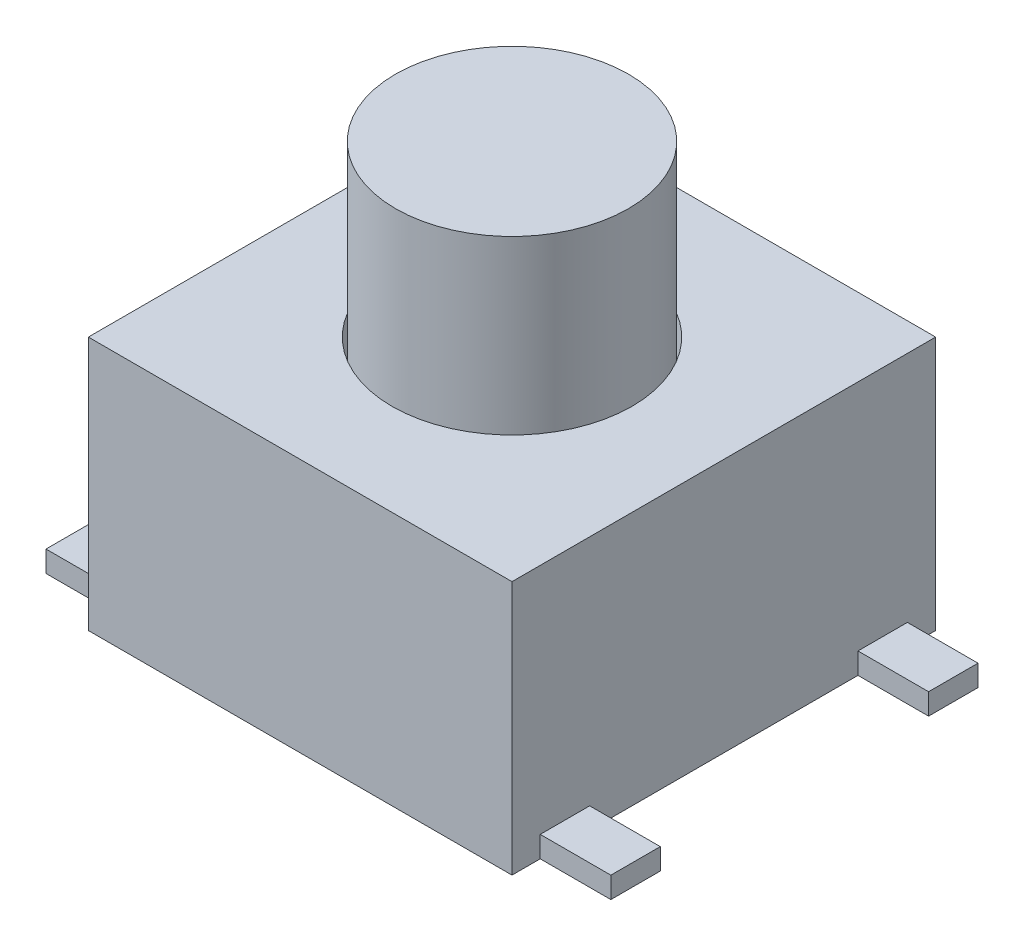
ISO-10303-21;
HEADER;
FILE_DESCRIPTION(('STEP AP214'),'2;1');
FILE_NAME('part.step','',(''),(''),'','','');
FILE_SCHEMA(('AUTOMOTIVE_DESIGN { 1 0 10303 214 1 1 1 1 }'));
ENDSEC;
DATA;
#1=APPLICATION_CONTEXT('core data for automotive mechanical design processes');
#2=APPLICATION_PROTOCOL_DEFINITION('international standard','automotive_design',2000,#1);
#3=PRODUCT_CONTEXT('',#1,'mechanical');
#4=PRODUCT('Part','Part','',(#3));
#5=PRODUCT_RELATED_PRODUCT_CATEGORY('part','',(#4));
#6=PRODUCT_DEFINITION_FORMATION('','',#4);
#7=PRODUCT_DEFINITION_CONTEXT('part definition',#1,'design');
#8=PRODUCT_DEFINITION('design','',#6,#7);
#9=PRODUCT_DEFINITION_SHAPE('','',#8);
#10=(LENGTH_UNIT() NAMED_UNIT(*) SI_UNIT(.MILLI.,.METRE.));
#11=(NAMED_UNIT(*) PLANE_ANGLE_UNIT() SI_UNIT($,.RADIAN.));
#12=(NAMED_UNIT(*) SI_UNIT($,.STERADIAN.) SOLID_ANGLE_UNIT());
#13=UNCERTAINTY_MEASURE_WITH_UNIT(LENGTH_MEASURE(1.E-05),#10,'distance_accuracy_value','');
#14=(GEOMETRIC_REPRESENTATION_CONTEXT(3) GLOBAL_UNCERTAINTY_ASSIGNED_CONTEXT((#13)) GLOBAL_UNIT_ASSIGNED_CONTEXT((#10,
#11,#12)) REPRESENTATION_CONTEXT('',''));
#15=CARTESIAN_POINT('',(0.,0.,0.));
#16=DIRECTION('',(0.,0.,1.));
#17=DIRECTION('',(1.,0.,0.));
#18=AXIS2_PLACEMENT_3D('',#15,#16,#17);
#19=CARTESIAN_POINT('',(0.,16.6669047558312,0.));
#20=DIRECTION('',(0.,-1.,0.));
#21=DIRECTION('',(0.,0.,-1.));
#22=AXIS2_PLACEMENT_3D('',#19,#20,#21);
#23=CYLINDRICAL_SURFACE('',#22,1.65);
#24=CARTESIAN_POINT('',(0.,1.,0.));
#25=DIRECTION('',(0.,1.,0.));
#26=DIRECTION('',(0.,0.,1.));
#27=AXIS2_PLACEMENT_3D('',#24,#25,#26);
#28=CIRCLE('',#27,1.65);
#29=CARTESIAN_POINT('',(0.,1.,1.65));
#30=VERTEX_POINT('',#29);
#31=EDGE_CURVE('E50',#30,#30,#28,.T.);
#32=ORIENTED_EDGE('',*,*,#31,.T.);
#33=EDGE_LOOP('',(#32));
#34=FACE_BOUND('',#33,.T.);
#35=CARTESIAN_POINT('',(0.,6.,0.));
#36=DIRECTION('',(0.,1.,0.));
#37=DIRECTION('',(0.,0.,1.));
#38=AXIS2_PLACEMENT_3D('',#35,#36,#37);
#39=CIRCLE('',#38,1.65);
#40=CARTESIAN_POINT('',(0.,6.,1.65));
#41=VERTEX_POINT('',#40);
#42=EDGE_CURVE('E11',#41,#41,#39,.T.);
#43=ORIENTED_EDGE('',*,*,#42,.F.);
#44=EDGE_LOOP('',(#43));
#45=FACE_BOUND('',#44,.T.);
#46=ADVANCED_FACE('F43',(#34,#45),#23,.T.);
#47=CARTESIAN_POINT('',(0.,1.,0.));
#48=DIRECTION('',(0.,1.,0.));
#49=DIRECTION('',(0.,0.,1.));
#50=AXIS2_PLACEMENT_3D('',#47,#48,#49);
#51=PLANE('',#50);
#52=ORIENTED_EDGE('',*,*,#31,.F.);
#53=EDGE_LOOP('',(#52));
#54=FACE_BOUND('',#53,.T.);
#55=ADVANCED_FACE('F58',(#54),#51,.F.);
#56=CARTESIAN_POINT('',(0.,6.,0.));
#57=DIRECTION('',(0.,1.,0.));
#58=DIRECTION('',(0.,0.,1.));
#59=AXIS2_PLACEMENT_3D('',#56,#57,#58);
#60=PLANE('',#59);
#61=ORIENTED_EDGE('',*,*,#42,.T.);
#62=EDGE_LOOP('',(#61));
#63=FACE_BOUND('',#62,.T.);
#64=ADVANCED_FACE('F45',(#63),#60,.T.);
#65=CLOSED_SHELL('',(#46,#55,#64));
#66=MANIFOLD_SOLID_BREP('B2',#65);
#67=CARTESIAN_POINT('',(-3.,3.6,-3.));
#68=DIRECTION('',(1.,0.,0.));
#69=DIRECTION('',(0.,0.,-1.));
#70=AXIS2_PLACEMENT_3D('',#67,#68,#69);
#71=PLANE('',#70);
#72=DIRECTION('',(0.,1.,0.));
#73=VECTOR('',#72,1.);
#74=CARTESIAN_POINT('',(-3.,0.,2.6));
#75=LINE('',#74,#73);
#76=CARTESIAN_POINT('',(-3.,0.,2.6));
#77=VERTEX_POINT('',#76);
#78=CARTESIAN_POINT('',(-3.,0.3,2.6));
#79=VERTEX_POINT('',#78);
#80=EDGE_CURVE('E291',#77,#79,#75,.T.);
#81=ORIENTED_EDGE('',*,*,#80,.F.);
#82=DIRECTION('',(0.,0.,1.));
#83=VECTOR('',#82,1.);
#84=CARTESIAN_POINT('',(-3.,0.,-3.));
#85=LINE('',#84,#83);
#86=CARTESIAN_POINT('',(-3.,0.,3.));
#87=VERTEX_POINT('',#86);
#88=EDGE_CURVE('E367',#77,#87,#85,.T.);
#89=ORIENTED_EDGE('',*,*,#88,.T.);
#90=DIRECTION('',(0.,-1.,0.));
#91=VECTOR('',#90,1.);
#92=CARTESIAN_POINT('',(-3.,3.6,3.));
#93=LINE('',#92,#91);
#94=CARTESIAN_POINT('',(-3.,3.6,3.));
#95=VERTEX_POINT('',#94);
#96=EDGE_CURVE('E374',#95,#87,#93,.T.);
#97=ORIENTED_EDGE('',*,*,#96,.F.);
#98=DIRECTION('',(0.,0.,1.));
#99=VECTOR('',#98,1.);
#100=CARTESIAN_POINT('',(-3.,3.6,-3.));
#101=LINE('',#100,#99);
#102=CARTESIAN_POINT('',(-3.,3.6,-3.));
#103=VERTEX_POINT('',#102);
#104=EDGE_CURVE('E358',#103,#95,#101,.T.);
#105=ORIENTED_EDGE('',*,*,#104,.F.);
#106=DIRECTION('',(0.,-1.,0.));
#107=VECTOR('',#106,1.);
#108=CARTESIAN_POINT('',(-3.,3.6,-3.));
#109=LINE('',#108,#107);
#110=CARTESIAN_POINT('',(-3.,0.,-3.));
#111=VERTEX_POINT('',#110);
#112=EDGE_CURVE('E92',#103,#111,#109,.T.);
#113=ORIENTED_EDGE('',*,*,#112,.T.);
#114=CARTESIAN_POINT('',(-3.,0.,-2.6));
#115=VERTEX_POINT('',#114);
#116=EDGE_CURVE('E368',#111,#115,#85,.T.);
#117=ORIENTED_EDGE('',*,*,#116,.T.);
#118=DIRECTION('',(0.,-1.,0.));
#119=VECTOR('',#118,1.);
#120=CARTESIAN_POINT('',(-3.,0.,-2.6));
#121=LINE('',#120,#119);
#122=CARTESIAN_POINT('',(-3.,0.3,-2.6));
#123=VERTEX_POINT('',#122);
#124=EDGE_CURVE('E321',#123,#115,#121,.T.);
#125=ORIENTED_EDGE('',*,*,#124,.F.);
#126=DIRECTION('',(0.,0.,-1.));
#127=VECTOR('',#126,1.);
#128=CARTESIAN_POINT('',(-3.,0.3,-2.6));
#129=LINE('',#128,#127);
#130=CARTESIAN_POINT('',(-3.,0.3,-1.9));
#131=VERTEX_POINT('',#130);
#132=EDGE_CURVE('E326',#131,#123,#129,.T.);
#133=ORIENTED_EDGE('',*,*,#132,.F.);
#134=DIRECTION('',(0.,1.,0.));
#135=VECTOR('',#134,1.);
#136=CARTESIAN_POINT('',(-3.,0.,-1.9));
#137=LINE('',#136,#135);
#138=CARTESIAN_POINT('',(-3.,0.,-1.9));
#139=VERTEX_POINT('',#138);
#140=EDGE_CURVE('E335',#139,#131,#137,.T.);
#141=ORIENTED_EDGE('',*,*,#140,.F.);
#142=CARTESIAN_POINT('',(-3.,0.,1.9));
#143=VERTEX_POINT('',#142);
#144=EDGE_CURVE('E370',#139,#143,#85,.T.);
#145=ORIENTED_EDGE('',*,*,#144,.T.);
#146=DIRECTION('',(0.,-1.,0.));
#147=VECTOR('',#146,1.);
#148=CARTESIAN_POINT('',(-3.,0.,1.9));
#149=LINE('',#148,#147);
#150=CARTESIAN_POINT('',(-3.,0.3,1.9));
#151=VERTEX_POINT('',#150);
#152=EDGE_CURVE('E296',#151,#143,#149,.T.);
#153=ORIENTED_EDGE('',*,*,#152,.F.);
#154=DIRECTION('',(0.,0.,-1.));
#155=VECTOR('',#154,1.);
#156=CARTESIAN_POINT('',(-3.,0.3,1.9));
#157=LINE('',#156,#155);
#158=EDGE_CURVE('E305',#79,#151,#157,.T.);
#159=ORIENTED_EDGE('',*,*,#158,.F.);
#160=EDGE_LOOP('',(#81,#89,#97,#105,#113,#117,#125,#133,#141,#145,#153,#159));
#161=FACE_BOUND('',#160,.T.);
#162=ADVANCED_FACE('F84',(#161),#71,.F.);
#163=CARTESIAN_POINT('',(3.,3.6,-3.));
#164=DIRECTION('',(-1.,0.,0.));
#165=DIRECTION('',(0.,0.,1.));
#166=AXIS2_PLACEMENT_3D('',#163,#164,#165);
#167=PLANE('',#166);
#168=DIRECTION('',(0.,0.,-1.));
#169=VECTOR('',#168,1.);
#170=CARTESIAN_POINT('',(3.,0.3,1.9));
#171=LINE('',#170,#169);
#172=CARTESIAN_POINT('',(3.,0.3,2.6));
#173=VERTEX_POINT('',#172);
#174=CARTESIAN_POINT('',(3.,0.3,1.9));
#175=VERTEX_POINT('',#174);
#176=EDGE_CURVE('E99',#173,#175,#171,.T.);
#177=ORIENTED_EDGE('',*,*,#176,.T.);
#178=DIRECTION('',(0.,-1.,0.));
#179=VECTOR('',#178,1.);
#180=CARTESIAN_POINT('',(3.,0.,1.9));
#181=LINE('',#180,#179);
#182=CARTESIAN_POINT('',(3.,0.,1.9));
#183=VERTEX_POINT('',#182);
#184=EDGE_CURVE('E253',#175,#183,#181,.T.);
#185=ORIENTED_EDGE('',*,*,#184,.T.);
#186=DIRECTION('',(0.,0.,-1.));
#187=VECTOR('',#186,1.);
#188=CARTESIAN_POINT('',(3.,0.,-3.));
#189=LINE('',#188,#187);
#190=CARTESIAN_POINT('',(3.,0.,-1.9));
#191=VERTEX_POINT('',#190);
#192=EDGE_CURVE('E229',#183,#191,#189,.T.);
#193=ORIENTED_EDGE('',*,*,#192,.T.);
#194=DIRECTION('',(0.,1.,0.));
#195=VECTOR('',#194,1.);
#196=CARTESIAN_POINT('',(3.,0.,-1.9));
#197=LINE('',#196,#195);
#198=CARTESIAN_POINT('',(3.,0.3,-1.9));
#199=VERTEX_POINT('',#198);
#200=EDGE_CURVE('E266',#191,#199,#197,.T.);
#201=ORIENTED_EDGE('',*,*,#200,.T.);
#202=DIRECTION('',(0.,0.,-1.));
#203=VECTOR('',#202,1.);
#204=CARTESIAN_POINT('',(3.,0.3,-2.6));
#205=LINE('',#204,#203);
#206=CARTESIAN_POINT('',(3.,0.3,-2.6));
#207=VERTEX_POINT('',#206);
#208=EDGE_CURVE('E278',#199,#207,#205,.T.);
#209=ORIENTED_EDGE('',*,*,#208,.T.);
#210=DIRECTION('',(0.,-1.,0.));
#211=VECTOR('',#210,1.);
#212=CARTESIAN_POINT('',(3.,0.,-2.6));
#213=LINE('',#212,#211);
#214=CARTESIAN_POINT('',(3.,0.,-2.6));
#215=VERTEX_POINT('',#214);
#216=EDGE_CURVE('E233',#207,#215,#213,.T.);
#217=ORIENTED_EDGE('',*,*,#216,.T.);
#218=CARTESIAN_POINT('',(3.,0.,-3.));
#219=VERTEX_POINT('',#218);
#220=EDGE_CURVE('E351',#215,#219,#189,.T.);
#221=ORIENTED_EDGE('',*,*,#220,.T.);
#222=DIRECTION('',(0.,-1.,0.));
#223=VECTOR('',#222,1.);
#224=CARTESIAN_POINT('',(3.,3.6,-3.));
#225=LINE('',#224,#223);
#226=CARTESIAN_POINT('',(3.,3.6,-3.));
#227=VERTEX_POINT('',#226);
#228=EDGE_CURVE('E41',#227,#219,#225,.T.);
#229=ORIENTED_EDGE('',*,*,#228,.F.);
#230=DIRECTION('',(0.,0.,-1.));
#231=VECTOR('',#230,1.);
#232=CARTESIAN_POINT('',(3.,3.6,-3.));
#233=LINE('',#232,#231);
#234=CARTESIAN_POINT('',(3.,3.6,3.));
#235=VERTEX_POINT('',#234);
#236=EDGE_CURVE('E352',#235,#227,#233,.T.);
#237=ORIENTED_EDGE('',*,*,#236,.F.);
#238=DIRECTION('',(0.,-1.,0.));
#239=VECTOR('',#238,1.);
#240=CARTESIAN_POINT('',(3.,3.6,3.));
#241=LINE('',#240,#239);
#242=CARTESIAN_POINT('',(3.,0.,3.));
#243=VERTEX_POINT('',#242);
#244=EDGE_CURVE('E362',#235,#243,#241,.T.);
#245=ORIENTED_EDGE('',*,*,#244,.T.);
#246=CARTESIAN_POINT('',(3.,0.,2.6));
#247=VERTEX_POINT('',#246);
#248=EDGE_CURVE('E363',#243,#247,#189,.T.);
#249=ORIENTED_EDGE('',*,*,#248,.T.);
#250=DIRECTION('',(0.,1.,0.));
#251=VECTOR('',#250,1.);
#252=CARTESIAN_POINT('',(3.,0.,2.6));
#253=LINE('',#252,#251);
#254=EDGE_CURVE('E104',#247,#173,#253,.T.);
#255=ORIENTED_EDGE('',*,*,#254,.T.);
#256=EDGE_LOOP('',(#177,#185,#193,#201,#209,#217,#221,#229,#237,#245,#249,#255));
#257=FACE_BOUND('',#256,.T.);
#258=ADVANCED_FACE('F86',(#257),#167,.F.);
#259=CARTESIAN_POINT('',(-3.,3.6,-3.));
#260=DIRECTION('',(0.,0.,1.));
#261=DIRECTION('',(1.,0.,0.));
#262=AXIS2_PLACEMENT_3D('',#259,#260,#261);
#263=PLANE('',#262);
#264=DIRECTION('',(-1.,0.,0.));
#265=VECTOR('',#264,1.);
#266=CARTESIAN_POINT('',(-3.,0.,-3.));
#267=LINE('',#266,#265);
#268=EDGE_CURVE('E365',#219,#111,#267,.T.);
#269=ORIENTED_EDGE('',*,*,#268,.T.);
#270=ORIENTED_EDGE('',*,*,#112,.F.);
#271=DIRECTION('',(-1.,0.,0.));
#272=VECTOR('',#271,1.);
#273=CARTESIAN_POINT('',(-3.,3.6,-3.));
#274=LINE('',#273,#272);
#275=EDGE_CURVE('E355',#227,#103,#274,.T.);
#276=ORIENTED_EDGE('',*,*,#275,.F.);
#277=ORIENTED_EDGE('',*,*,#228,.T.);
#278=EDGE_LOOP('',(#269,#270,#276,#277));
#279=FACE_BOUND('',#278,.T.);
#280=ADVANCED_FACE('F412',(#279),#263,.F.);
#281=CARTESIAN_POINT('',(-3.,3.6,3.));
#282=DIRECTION('',(0.,0.,-1.));
#283=DIRECTION('',(-1.,0.,0.));
#284=AXIS2_PLACEMENT_3D('',#281,#282,#283);
#285=PLANE('',#284);
#286=DIRECTION('',(1.,0.,0.));
#287=VECTOR('',#286,1.);
#288=CARTESIAN_POINT('',(-3.,0.,3.));
#289=LINE('',#288,#287);
#290=EDGE_CURVE('E356',#87,#243,#289,.T.);
#291=ORIENTED_EDGE('',*,*,#290,.T.);
#292=ORIENTED_EDGE('',*,*,#244,.F.);
#293=DIRECTION('',(1.,0.,0.));
#294=VECTOR('',#293,1.);
#295=CARTESIAN_POINT('',(-3.,3.6,3.));
#296=LINE('',#295,#294);
#297=EDGE_CURVE('E360',#95,#235,#296,.T.);
#298=ORIENTED_EDGE('',*,*,#297,.F.);
#299=ORIENTED_EDGE('',*,*,#96,.T.);
#300=EDGE_LOOP('',(#291,#292,#298,#299));
#301=FACE_BOUND('',#300,.T.);
#302=ADVANCED_FACE('F406',(#301),#285,.F.);
#303=CARTESIAN_POINT('',(0.,3.6,0.));
#304=DIRECTION('',(0.,1.,0.));
#305=DIRECTION('',(0.,0.,1.));
#306=AXIS2_PLACEMENT_3D('',#303,#304,#305);
#307=PLANE('',#306);
#308=CARTESIAN_POINT('',(0.,3.6,0.));
#309=DIRECTION('',(0.,1.,0.));
#310=DIRECTION('',(0.,0.,1.));
#311=AXIS2_PLACEMENT_3D('',#308,#309,#310);
#312=CIRCLE('',#311,1.7);
#313=CARTESIAN_POINT('',(0.,3.6,1.7));
#314=VERTEX_POINT('',#313);
#315=EDGE_CURVE('E494',#314,#314,#312,.T.);
#316=ORIENTED_EDGE('',*,*,#315,.F.);
#317=EDGE_LOOP('',(#316));
#318=FACE_BOUND('',#317,.T.);
#319=ORIENTED_EDGE('',*,*,#236,.T.);
#320=ORIENTED_EDGE('',*,*,#275,.T.);
#321=ORIENTED_EDGE('',*,*,#104,.T.);
#322=ORIENTED_EDGE('',*,*,#297,.T.);
#323=EDGE_LOOP('',(#319,#320,#321,#322));
#324=FACE_BOUND('',#323,.T.);
#325=ADVANCED_FACE('F411',(#318,#324),#307,.T.);
#326=CARTESIAN_POINT('',(0.,0.,0.));
#327=DIRECTION('',(0.,1.,0.));
#328=DIRECTION('',(0.,0.,1.));
#329=AXIS2_PLACEMENT_3D('',#326,#327,#328);
#330=PLANE('',#329);
#331=ORIENTED_EDGE('',*,*,#248,.F.);
#332=ORIENTED_EDGE('',*,*,#290,.F.);
#333=ORIENTED_EDGE('',*,*,#88,.F.);
#334=DIRECTION('',(1.,0.,0.));
#335=VECTOR('',#334,1.);
#336=CARTESIAN_POINT('',(-4.,0.,2.6));
#337=LINE('',#336,#335);
#338=CARTESIAN_POINT('',(-4.,0.,2.6));
#339=VERTEX_POINT('',#338);
#340=EDGE_CURVE('E318',#339,#77,#337,.T.);
#341=ORIENTED_EDGE('',*,*,#340,.F.);
#342=DIRECTION('',(0.,0.,1.));
#343=VECTOR('',#342,1.);
#344=CARTESIAN_POINT('',(-4.,0.,1.9));
#345=LINE('',#344,#343);
#346=CARTESIAN_POINT('',(-4.,0.,1.9));
#347=VERTEX_POINT('',#346);
#348=EDGE_CURVE('E292',#347,#339,#345,.T.);
#349=ORIENTED_EDGE('',*,*,#348,.F.);
#350=DIRECTION('',(1.,0.,0.));
#351=VECTOR('',#350,1.);
#352=CARTESIAN_POINT('',(-4.,0.,1.9));
#353=LINE('',#352,#351);
#354=EDGE_CURVE('E302',#347,#143,#353,.T.);
#355=ORIENTED_EDGE('',*,*,#354,.T.);
#356=ORIENTED_EDGE('',*,*,#144,.F.);
#357=DIRECTION('',(1.,0.,0.));
#358=VECTOR('',#357,1.);
#359=CARTESIAN_POINT('',(-4.,0.,-1.9));
#360=LINE('',#359,#358);
#361=CARTESIAN_POINT('',(-4.,0.,-1.9));
#362=VERTEX_POINT('',#361);
#363=EDGE_CURVE('E345',#362,#139,#360,.T.);
#364=ORIENTED_EDGE('',*,*,#363,.F.);
#365=DIRECTION('',(0.,0.,1.));
#366=VECTOR('',#365,1.);
#367=CARTESIAN_POINT('',(-4.,0.,-2.6));
#368=LINE('',#367,#366);
#369=CARTESIAN_POINT('',(-4.,0.,-2.6));
#370=VERTEX_POINT('',#369);
#371=EDGE_CURVE('E325',#370,#362,#368,.T.);
#372=ORIENTED_EDGE('',*,*,#371,.F.);
#373=DIRECTION('',(1.,0.,0.));
#374=VECTOR('',#373,1.);
#375=CARTESIAN_POINT('',(-4.,0.,-2.6));
#376=LINE('',#375,#374);
#377=EDGE_CURVE('E348',#370,#115,#376,.T.);
#378=ORIENTED_EDGE('',*,*,#377,.T.);
#379=ORIENTED_EDGE('',*,*,#116,.F.);
#380=ORIENTED_EDGE('',*,*,#268,.F.);
#381=ORIENTED_EDGE('',*,*,#220,.F.);
#382=DIRECTION('',(-1.,0.,0.));
#383=VECTOR('',#382,1.);
#384=CARTESIAN_POINT('',(4.,0.,-2.6));
#385=LINE('',#384,#383);
#386=CARTESIAN_POINT('',(4.,0.,-2.6));
#387=VERTEX_POINT('',#386);
#388=EDGE_CURVE('E275',#387,#215,#385,.T.);
#389=ORIENTED_EDGE('',*,*,#388,.F.);
#390=DIRECTION('',(0.,0.,1.));
#391=VECTOR('',#390,1.);
#392=CARTESIAN_POINT('',(4.,0.,-2.6));
#393=LINE('',#392,#391);
#394=CARTESIAN_POINT('',(4.,0.,-1.9));
#395=VERTEX_POINT('',#394);
#396=EDGE_CURVE('E272',#387,#395,#393,.T.);
#397=ORIENTED_EDGE('',*,*,#396,.T.);
#398=DIRECTION('',(-1.,0.,0.));
#399=VECTOR('',#398,1.);
#400=CARTESIAN_POINT('',(4.,0.,-1.9));
#401=LINE('',#400,#399);
#402=EDGE_CURVE('E284',#395,#191,#401,.T.);
#403=ORIENTED_EDGE('',*,*,#402,.T.);
#404=ORIENTED_EDGE('',*,*,#192,.F.);
#405=DIRECTION('',(-1.,0.,0.));
#406=VECTOR('',#405,1.);
#407=CARTESIAN_POINT('',(4.,0.,1.9));
#408=LINE('',#407,#406);
#409=CARTESIAN_POINT('',(4.,0.,1.9));
#410=VERTEX_POINT('',#409);
#411=EDGE_CURVE('E221',#410,#183,#408,.T.);
#412=ORIENTED_EDGE('',*,*,#411,.F.);
#413=DIRECTION('',(0.,0.,1.));
#414=VECTOR('',#413,1.);
#415=CARTESIAN_POINT('',(4.,0.,1.9));
#416=LINE('',#415,#414);
#417=CARTESIAN_POINT('',(4.,0.,2.6));
#418=VERTEX_POINT('',#417);
#419=EDGE_CURVE('E226',#410,#418,#416,.T.);
#420=ORIENTED_EDGE('',*,*,#419,.T.);
#421=DIRECTION('',(-1.,0.,0.));
#422=VECTOR('',#421,1.);
#423=CARTESIAN_POINT('',(4.,0.,2.6));
#424=LINE('',#423,#422);
#425=EDGE_CURVE('E252',#418,#247,#424,.T.);
#426=ORIENTED_EDGE('',*,*,#425,.T.);
#427=EDGE_LOOP('',(#331,#332,#333,#341,#349,#355,#356,#364,#372,#378,#379,#380,#381,#389,#397,
#403,#404,#412,#420,#426));
#428=FACE_BOUND('',#427,.T.);
#429=ADVANCED_FACE('F224',(#428),#330,.F.);
#430=CARTESIAN_POINT('',(-4.,0.,-2.6));
#431=DIRECTION('',(0.,0.,1.));
#432=DIRECTION('',(1.,0.,0.));
#433=AXIS2_PLACEMENT_3D('',#430,#431,#432);
#434=PLANE('',#433);
#435=ORIENTED_EDGE('',*,*,#124,.T.);
#436=ORIENTED_EDGE('',*,*,#377,.F.);
#437=DIRECTION('',(0.,-1.,0.));
#438=VECTOR('',#437,1.);
#439=CARTESIAN_POINT('',(-4.,0.,-2.6));
#440=LINE('',#439,#438);
#441=CARTESIAN_POINT('',(-4.,0.3,-2.6));
#442=VERTEX_POINT('',#441);
#443=EDGE_CURVE('E322',#442,#370,#440,.T.);
#444=ORIENTED_EDGE('',*,*,#443,.F.);
#445=DIRECTION('',(1.,0.,0.));
#446=VECTOR('',#445,1.);
#447=CARTESIAN_POINT('',(-4.,0.3,-2.6));
#448=LINE('',#447,#446);
#449=EDGE_CURVE('E332',#442,#123,#448,.T.);
#450=ORIENTED_EDGE('',*,*,#449,.T.);
#451=EDGE_LOOP('',(#435,#436,#444,#450));
#452=FACE_BOUND('',#451,.T.);
#453=ADVANCED_FACE('F390',(#452),#434,.F.);
#454=CARTESIAN_POINT('',(-4.,0.,-1.9));
#455=DIRECTION('',(0.,0.,-1.));
#456=DIRECTION('',(0.,1.,0.));
#457=AXIS2_PLACEMENT_3D('',#454,#455,#456);
#458=PLANE('',#457);
#459=ORIENTED_EDGE('',*,*,#140,.T.);
#460=DIRECTION('',(1.,0.,0.));
#461=VECTOR('',#460,1.);
#462=CARTESIAN_POINT('',(-4.,0.3,-1.9));
#463=LINE('',#462,#461);
#464=CARTESIAN_POINT('',(-4.,0.3,-1.9));
#465=VERTEX_POINT('',#464);
#466=EDGE_CURVE('E342',#465,#131,#463,.T.);
#467=ORIENTED_EDGE('',*,*,#466,.F.);
#468=DIRECTION('',(0.,1.,0.));
#469=VECTOR('',#468,1.);
#470=CARTESIAN_POINT('',(-4.,0.,-1.9));
#471=LINE('',#470,#469);
#472=EDGE_CURVE('E328',#362,#465,#471,.T.);
#473=ORIENTED_EDGE('',*,*,#472,.F.);
#474=ORIENTED_EDGE('',*,*,#363,.T.);
#475=EDGE_LOOP('',(#459,#467,#473,#474));
#476=FACE_BOUND('',#475,.T.);
#477=ADVANCED_FACE('F398',(#476),#458,.F.);
#478=CARTESIAN_POINT('',(-4.,0.3,-2.6));
#479=DIRECTION('',(0.,-1.,0.));
#480=DIRECTION('',(0.,0.,-1.));
#481=AXIS2_PLACEMENT_3D('',#478,#479,#480);
#482=PLANE('',#481);
#483=ORIENTED_EDGE('',*,*,#132,.T.);
#484=ORIENTED_EDGE('',*,*,#449,.F.);
#485=DIRECTION('',(0.,0.,-1.));
#486=VECTOR('',#485,1.);
#487=CARTESIAN_POINT('',(-4.,0.3,-2.6));
#488=LINE('',#487,#486);
#489=EDGE_CURVE('E330',#465,#442,#488,.T.);
#490=ORIENTED_EDGE('',*,*,#489,.F.);
#491=ORIENTED_EDGE('',*,*,#466,.T.);
#492=EDGE_LOOP('',(#483,#484,#490,#491));
#493=FACE_BOUND('',#492,.T.);
#494=ADVANCED_FACE('F393',(#493),#482,.F.);
#495=CARTESIAN_POINT('',(-4.,0.,0.));
#496=DIRECTION('',(1.,0.,0.));
#497=DIRECTION('',(0.,0.,-1.));
#498=AXIS2_PLACEMENT_3D('',#495,#496,#497);
#499=PLANE('',#498);
#500=ORIENTED_EDGE('',*,*,#443,.T.);
#501=ORIENTED_EDGE('',*,*,#371,.T.);
#502=ORIENTED_EDGE('',*,*,#472,.T.);
#503=ORIENTED_EDGE('',*,*,#489,.T.);
#504=EDGE_LOOP('',(#500,#501,#502,#503));
#505=FACE_BOUND('',#504,.T.);
#506=ADVANCED_FACE('F435',(#505),#499,.F.);
#507=CARTESIAN_POINT('',(-4.,0.,2.6));
#508=DIRECTION('',(0.,0.,-1.));
#509=DIRECTION('',(-1.,0.,0.));
#510=AXIS2_PLACEMENT_3D('',#507,#508,#509);
#511=PLANE('',#510);
#512=ORIENTED_EDGE('',*,*,#80,.T.);
#513=DIRECTION('',(1.,0.,0.));
#514=VECTOR('',#513,1.);
#515=CARTESIAN_POINT('',(-4.,0.3,2.6));
#516=LINE('',#515,#514);
#517=CARTESIAN_POINT('',(-4.,0.3,2.6));
#518=VERTEX_POINT('',#517);
#519=EDGE_CURVE('E315',#518,#79,#516,.T.);
#520=ORIENTED_EDGE('',*,*,#519,.F.);
#521=DIRECTION('',(0.,1.,0.));
#522=VECTOR('',#521,1.);
#523=CARTESIAN_POINT('',(-4.,0.,2.6));
#524=LINE('',#523,#522);
#525=EDGE_CURVE('E295',#339,#518,#524,.T.);
#526=ORIENTED_EDGE('',*,*,#525,.F.);
#527=ORIENTED_EDGE('',*,*,#340,.T.);
#528=EDGE_LOOP('',(#512,#520,#526,#527));
#529=FACE_BOUND('',#528,.T.);
#530=ADVANCED_FACE('F438',(#529),#511,.F.);
#531=CARTESIAN_POINT('',(-4.,0.3,1.9));
#532=DIRECTION('',(0.,-1.,0.));
#533=DIRECTION('',(0.,0.,-1.));
#534=AXIS2_PLACEMENT_3D('',#531,#532,#533);
#535=PLANE('',#534);
#536=ORIENTED_EDGE('',*,*,#158,.T.);
#537=DIRECTION('',(1.,0.,0.));
#538=VECTOR('',#537,1.);
#539=CARTESIAN_POINT('',(-4.,0.3,1.9));
#540=LINE('',#539,#538);
#541=CARTESIAN_POINT('',(-4.,0.3,1.9));
#542=VERTEX_POINT('',#541);
#543=EDGE_CURVE('E312',#542,#151,#540,.T.);
#544=ORIENTED_EDGE('',*,*,#543,.F.);
#545=DIRECTION('',(0.,0.,-1.));
#546=VECTOR('',#545,1.);
#547=CARTESIAN_POINT('',(-4.,0.3,1.9));
#548=LINE('',#547,#546);
#549=EDGE_CURVE('E298',#518,#542,#548,.T.);
#550=ORIENTED_EDGE('',*,*,#549,.F.);
#551=ORIENTED_EDGE('',*,*,#519,.T.);
#552=EDGE_LOOP('',(#536,#544,#550,#551));
#553=FACE_BOUND('',#552,.T.);
#554=ADVANCED_FACE('F442',(#553),#535,.F.);
#555=CARTESIAN_POINT('',(-4.,0.,1.9));
#556=DIRECTION('',(0.,0.,1.));
#557=DIRECTION('',(0.,-1.,0.));
#558=AXIS2_PLACEMENT_3D('',#555,#556,#557);
#559=PLANE('',#558);
#560=ORIENTED_EDGE('',*,*,#152,.T.);
#561=ORIENTED_EDGE('',*,*,#354,.F.);
#562=DIRECTION('',(0.,-1.,0.));
#563=VECTOR('',#562,1.);
#564=CARTESIAN_POINT('',(-4.,0.,1.9));
#565=LINE('',#564,#563);
#566=EDGE_CURVE('E300',#542,#347,#565,.T.);
#567=ORIENTED_EDGE('',*,*,#566,.F.);
#568=ORIENTED_EDGE('',*,*,#543,.T.);
#569=EDGE_LOOP('',(#560,#561,#567,#568));
#570=FACE_BOUND('',#569,.T.);
#571=ADVANCED_FACE('F446',(#570),#559,.F.);
#572=CARTESIAN_POINT('',(-4.,0.,0.));
#573=DIRECTION('',(-1.,0.,0.));
#574=DIRECTION('',(0.,0.,1.));
#575=AXIS2_PLACEMENT_3D('',#572,#573,#574);
#576=PLANE('',#575);
#577=ORIENTED_EDGE('',*,*,#348,.T.);
#578=ORIENTED_EDGE('',*,*,#525,.T.);
#579=ORIENTED_EDGE('',*,*,#549,.T.);
#580=ORIENTED_EDGE('',*,*,#566,.T.);
#581=EDGE_LOOP('',(#577,#578,#579,#580));
#582=FACE_BOUND('',#581,.T.);
#583=ADVANCED_FACE('F450',(#582),#576,.T.);
#584=CARTESIAN_POINT('',(4.,0.,-2.6));
#585=DIRECTION('',(0.,0.,-1.));
#586=DIRECTION('',(-1.,0.,0.));
#587=AXIS2_PLACEMENT_3D('',#584,#585,#586);
#588=PLANE('',#587);
#589=ORIENTED_EDGE('',*,*,#216,.F.);
#590=DIRECTION('',(-1.,0.,0.));
#591=VECTOR('',#590,1.);
#592=CARTESIAN_POINT('',(4.,0.3,-2.6));
#593=LINE('',#592,#591);
#594=CARTESIAN_POINT('',(4.,0.3,-2.6));
#595=VERTEX_POINT('',#594);
#596=EDGE_CURVE('E288',#595,#207,#593,.T.);
#597=ORIENTED_EDGE('',*,*,#596,.F.);
#598=DIRECTION('',(0.,-1.,0.));
#599=VECTOR('',#598,1.);
#600=CARTESIAN_POINT('',(4.,0.,-2.6));
#601=LINE('',#600,#599);
#602=EDGE_CURVE('E262',#595,#387,#601,.T.);
#603=ORIENTED_EDGE('',*,*,#602,.T.);
#604=ORIENTED_EDGE('',*,*,#388,.T.);
#605=EDGE_LOOP('',(#589,#597,#603,#604));
#606=FACE_BOUND('',#605,.T.);
#607=ADVANCED_FACE('F454',(#606),#588,.T.);
#608=CARTESIAN_POINT('',(4.,0.3,-2.6));
#609=DIRECTION('',(0.,1.,0.));
#610=DIRECTION('',(0.,0.,1.));
#611=AXIS2_PLACEMENT_3D('',#608,#609,#610);
#612=PLANE('',#611);
#613=ORIENTED_EDGE('',*,*,#208,.F.);
#614=DIRECTION('',(-1.,0.,0.));
#615=VECTOR('',#614,1.);
#616=CARTESIAN_POINT('',(4.,0.3,-1.9));
#617=LINE('',#616,#615);
#618=CARTESIAN_POINT('',(4.,0.3,-1.9));
#619=VERTEX_POINT('',#618);
#620=EDGE_CURVE('E286',#619,#199,#617,.T.);
#621=ORIENTED_EDGE('',*,*,#620,.F.);
#622=DIRECTION('',(0.,0.,-1.));
#623=VECTOR('',#622,1.);
#624=CARTESIAN_POINT('',(4.,0.3,-2.6));
#625=LINE('',#624,#623);
#626=EDGE_CURVE('E265',#619,#595,#625,.T.);
#627=ORIENTED_EDGE('',*,*,#626,.T.);
#628=ORIENTED_EDGE('',*,*,#596,.T.);
#629=EDGE_LOOP('',(#613,#621,#627,#628));
#630=FACE_BOUND('',#629,.T.);
#631=ADVANCED_FACE('F458',(#630),#612,.T.);
#632=CARTESIAN_POINT('',(4.,0.,-1.9));
#633=DIRECTION('',(0.,0.,1.));
#634=DIRECTION('',(0.,-1.,0.));
#635=AXIS2_PLACEMENT_3D('',#632,#633,#634);
#636=PLANE('',#635);
#637=ORIENTED_EDGE('',*,*,#200,.F.);
#638=ORIENTED_EDGE('',*,*,#402,.F.);
#639=DIRECTION('',(0.,1.,0.));
#640=VECTOR('',#639,1.);
#641=CARTESIAN_POINT('',(4.,0.,-1.9));
#642=LINE('',#641,#640);
#643=EDGE_CURVE('E269',#395,#619,#642,.T.);
#644=ORIENTED_EDGE('',*,*,#643,.T.);
#645=ORIENTED_EDGE('',*,*,#620,.T.);
#646=EDGE_LOOP('',(#637,#638,#644,#645));
#647=FACE_BOUND('',#646,.T.);
#648=ADVANCED_FACE('F462',(#647),#636,.T.);
#649=CARTESIAN_POINT('',(4.,0.,0.));
#650=DIRECTION('',(-1.,0.,0.));
#651=DIRECTION('',(0.,0.,-1.));
#652=AXIS2_PLACEMENT_3D('',#649,#650,#651);
#653=PLANE('',#652);
#654=ORIENTED_EDGE('',*,*,#602,.F.);
#655=ORIENTED_EDGE('',*,*,#626,.F.);
#656=ORIENTED_EDGE('',*,*,#643,.F.);
#657=ORIENTED_EDGE('',*,*,#396,.F.);
#658=EDGE_LOOP('',(#654,#655,#656,#657));
#659=FACE_BOUND('',#658,.T.);
#660=ADVANCED_FACE('F466',(#659),#653,.F.);
#661=CARTESIAN_POINT('',(4.,0.,1.9));
#662=DIRECTION('',(0.,0.,-1.));
#663=DIRECTION('',(0.,1.,0.));
#664=AXIS2_PLACEMENT_3D('',#661,#662,#663);
#665=PLANE('',#664);
#666=ORIENTED_EDGE('',*,*,#184,.F.);
#667=DIRECTION('',(-1.,0.,0.));
#668=VECTOR('',#667,1.);
#669=CARTESIAN_POINT('',(4.,0.3,1.9));
#670=LINE('',#669,#668);
#671=CARTESIAN_POINT('',(4.,0.3,1.9));
#672=VERTEX_POINT('',#671);
#673=EDGE_CURVE('E234',#672,#175,#670,.T.);
#674=ORIENTED_EDGE('',*,*,#673,.F.);
#675=DIRECTION('',(0.,-1.,0.));
#676=VECTOR('',#675,1.);
#677=CARTESIAN_POINT('',(4.,0.,1.9));
#678=LINE('',#677,#676);
#679=EDGE_CURVE('E240',#672,#410,#678,.T.);
#680=ORIENTED_EDGE('',*,*,#679,.T.);
#681=ORIENTED_EDGE('',*,*,#411,.T.);
#682=EDGE_LOOP('',(#666,#674,#680,#681));
#683=FACE_BOUND('',#682,.T.);
#684=ADVANCED_FACE('F245',(#683),#665,.T.);
#685=CARTESIAN_POINT('',(4.,0.3,1.9));
#686=DIRECTION('',(0.,1.,0.));
#687=DIRECTION('',(0.,0.,1.));
#688=AXIS2_PLACEMENT_3D('',#685,#686,#687);
#689=PLANE('',#688);
#690=ORIENTED_EDGE('',*,*,#176,.F.);
#691=DIRECTION('',(-1.,0.,0.));
#692=VECTOR('',#691,1.);
#693=CARTESIAN_POINT('',(4.,0.3,2.6));
#694=LINE('',#693,#692);
#695=CARTESIAN_POINT('',(4.,0.3,2.6));
#696=VERTEX_POINT('',#695);
#697=EDGE_CURVE('E259',#696,#173,#694,.T.);
#698=ORIENTED_EDGE('',*,*,#697,.F.);
#699=DIRECTION('',(0.,0.,-1.));
#700=VECTOR('',#699,1.);
#701=CARTESIAN_POINT('',(4.,0.3,1.9));
#702=LINE('',#701,#700);
#703=EDGE_CURVE('E246',#696,#672,#702,.T.);
#704=ORIENTED_EDGE('',*,*,#703,.T.);
#705=ORIENTED_EDGE('',*,*,#673,.T.);
#706=EDGE_LOOP('',(#690,#698,#704,#705));
#707=FACE_BOUND('',#706,.T.);
#708=ADVANCED_FACE('F473',(#707),#689,.T.);
#709=CARTESIAN_POINT('',(4.,0.,2.6));
#710=DIRECTION('',(0.,0.,1.));
#711=DIRECTION('',(1.,0.,0.));
#712=AXIS2_PLACEMENT_3D('',#709,#710,#711);
#713=PLANE('',#712);
#714=ORIENTED_EDGE('',*,*,#254,.F.);
#715=ORIENTED_EDGE('',*,*,#425,.F.);
#716=DIRECTION('',(0.,1.,0.));
#717=VECTOR('',#716,1.);
#718=CARTESIAN_POINT('',(4.,0.,2.6));
#719=LINE('',#718,#717);
#720=EDGE_CURVE('E243',#418,#696,#719,.T.);
#721=ORIENTED_EDGE('',*,*,#720,.T.);
#722=ORIENTED_EDGE('',*,*,#697,.T.);
#723=EDGE_LOOP('',(#714,#715,#721,#722));
#724=FACE_BOUND('',#723,.T.);
#725=ADVANCED_FACE('F476',(#724),#713,.T.);
#726=CARTESIAN_POINT('',(4.,0.,0.));
#727=DIRECTION('',(1.,0.,0.));
#728=DIRECTION('',(0.,0.,1.));
#729=AXIS2_PLACEMENT_3D('',#726,#727,#728);
#730=PLANE('',#729);
#731=ORIENTED_EDGE('',*,*,#419,.F.);
#732=ORIENTED_EDGE('',*,*,#679,.F.);
#733=ORIENTED_EDGE('',*,*,#703,.F.);
#734=ORIENTED_EDGE('',*,*,#720,.F.);
#735=EDGE_LOOP('',(#731,#732,#733,#734));
#736=FACE_BOUND('',#735,.T.);
#737=ADVANCED_FACE('F238',(#736),#730,.T.);
#738=CARTESIAN_POINT('',(0.,-4.80832611206852,0.));
#739=DIRECTION('',(0.,1.,0.));
#740=DIRECTION('',(0.,0.,1.));
#741=AXIS2_PLACEMENT_3D('',#738,#739,#740);
#742=CYLINDRICAL_SURFACE('',#741,1.7);
#743=CARTESIAN_POINT('',(0.,1.,0.));
#744=DIRECTION('',(0.,1.,0.));
#745=DIRECTION('',(0.,0.,1.));
#746=AXIS2_PLACEMENT_3D('',#743,#744,#745);
#747=CIRCLE('',#746,1.7);
#748=CARTESIAN_POINT('',(0.,1.,1.7));
#749=VERTEX_POINT('',#748);
#750=EDGE_CURVE('E255',#749,#749,#747,.F.);
#751=ORIENTED_EDGE('',*,*,#750,.T.);
#752=EDGE_LOOP('',(#751));
#753=FACE_BOUND('',#752,.T.);
#754=ORIENTED_EDGE('',*,*,#315,.T.);
#755=EDGE_LOOP('',(#754));
#756=FACE_BOUND('',#755,.T.);
#757=ADVANCED_FACE('F483',(#753,#756),#742,.F.);
#758=CARTESIAN_POINT('',(0.,1.,0.));
#759=DIRECTION('',(0.,1.,0.));
#760=DIRECTION('',(0.,0.,1.));
#761=AXIS2_PLACEMENT_3D('',#758,#759,#760);
#762=PLANE('',#761);
#763=ORIENTED_EDGE('',*,*,#750,.F.);
#764=EDGE_LOOP('',(#763));
#765=FACE_BOUND('',#764,.T.);
#766=ADVANCED_FACE('F486',(#765),#762,.T.);
#767=CLOSED_SHELL('',(#162,#258,#280,#302,#325,#429,#453,#477,#494,#506,#530,#554,#571,#583,
#607,#631,#648,#660,#684,#708,#725,#737,#757,#766));
#768=MANIFOLD_SOLID_BREP('B6',#767);
#769=ADVANCED_BREP_SHAPE_REPRESENTATION('',(#18,#66,#768),#14);
#770=SHAPE_DEFINITION_REPRESENTATION(#9,#769);
ENDSEC;
END-ISO-10303-21;
